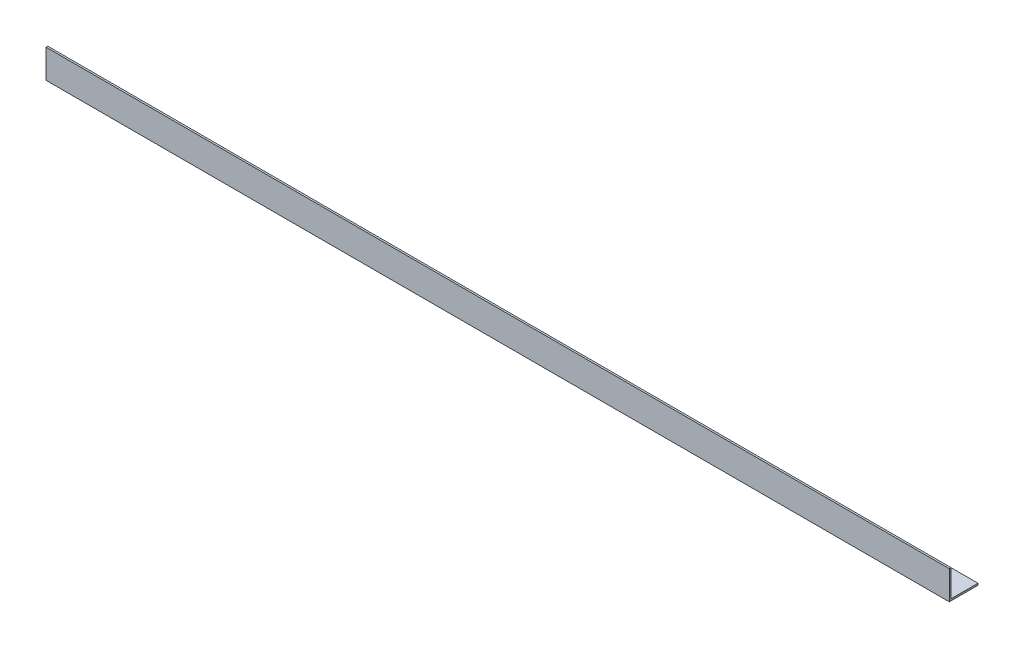
ISO-10303-21;
HEADER;
FILE_DESCRIPTION(('STEP AP214'),'2;1');
FILE_NAME('part.step','',(''),(''),'','','');
FILE_SCHEMA(('AUTOMOTIVE_DESIGN { 1 0 10303 214 1 1 1 1 }'));
ENDSEC;
DATA;
#1=APPLICATION_CONTEXT('core data for automotive mechanical design processes');
#2=APPLICATION_PROTOCOL_DEFINITION('international standard','automotive_design',2000,#1);
#3=PRODUCT_CONTEXT('',#1,'mechanical');
#4=PRODUCT('Part','Part','',(#3));
#5=PRODUCT_RELATED_PRODUCT_CATEGORY('part','',(#4));
#6=PRODUCT_DEFINITION_FORMATION('','',#4);
#7=PRODUCT_DEFINITION_CONTEXT('part definition',#1,'design');
#8=PRODUCT_DEFINITION('design','',#6,#7);
#9=PRODUCT_DEFINITION_SHAPE('','',#8);
#10=(LENGTH_UNIT() NAMED_UNIT(*) SI_UNIT(.MILLI.,.METRE.));
#11=(NAMED_UNIT(*) PLANE_ANGLE_UNIT() SI_UNIT($,.RADIAN.));
#12=(NAMED_UNIT(*) SI_UNIT($,.STERADIAN.) SOLID_ANGLE_UNIT());
#13=UNCERTAINTY_MEASURE_WITH_UNIT(LENGTH_MEASURE(1.E-05),#10,'distance_accuracy_value','');
#14=(GEOMETRIC_REPRESENTATION_CONTEXT(3) GLOBAL_UNCERTAINTY_ASSIGNED_CONTEXT((#13)) GLOBAL_UNIT_ASSIGNED_CONTEXT((#10,
#11,#12)) REPRESENTATION_CONTEXT('',''));
#15=CARTESIAN_POINT('',(0.,0.,0.));
#16=DIRECTION('',(0.,0.,1.));
#17=DIRECTION('',(1.,0.,0.));
#18=AXIS2_PLACEMENT_3D('',#15,#16,#17);
#19=CARTESIAN_POINT('',(800.1,0.,0.));
#20=DIRECTION('',(0.,1.,0.));
#21=DIRECTION('',(0.,0.,1.));
#22=AXIS2_PLACEMENT_3D('',#19,#20,#21);
#23=PLANE('',#22);
#24=DIRECTION('',(0.,0.,-1.));
#25=VECTOR('',#24,1.);
#26=CARTESIAN_POINT('',(0.,0.,0.));
#27=LINE('',#26,#25);
#28=CARTESIAN_POINT('',(0.,0.,0.));
#29=VERTEX_POINT('',#28);
#30=CARTESIAN_POINT('',(0.,0.,-25.4));
#31=VERTEX_POINT('',#30);
#32=EDGE_CURVE('E121',#29,#31,#27,.T.);
#33=ORIENTED_EDGE('',*,*,#32,.T.);
#34=DIRECTION('',(-1.,0.,0.));
#35=VECTOR('',#34,1.);
#36=CARTESIAN_POINT('',(800.1,0.,-25.4));
#37=LINE('',#36,#35);
#38=CARTESIAN_POINT('',(800.1,0.,-25.4));
#39=VERTEX_POINT('',#38);
#40=EDGE_CURVE('E11',#39,#31,#37,.T.);
#41=ORIENTED_EDGE('',*,*,#40,.F.);
#42=DIRECTION('',(0.,0.,-1.));
#43=VECTOR('',#42,1.);
#44=CARTESIAN_POINT('',(800.1,0.,0.));
#45=LINE('',#44,#43);
#46=CARTESIAN_POINT('',(800.1,0.,0.));
#47=VERTEX_POINT('',#46);
#48=EDGE_CURVE('E131',#47,#39,#45,.T.);
#49=ORIENTED_EDGE('',*,*,#48,.F.);
#50=DIRECTION('',(-1.,0.,0.));
#51=VECTOR('',#50,1.);
#52=CARTESIAN_POINT('',(800.1,0.,0.));
#53=LINE('',#52,#51);
#54=EDGE_CURVE('E117',#47,#29,#53,.T.);
#55=ORIENTED_EDGE('',*,*,#54,.T.);
#56=EDGE_LOOP('',(#33,#41,#49,#55));
#57=FACE_BOUND('',#56,.T.);
#58=ADVANCED_FACE('F37',(#57),#23,.F.);
#59=CARTESIAN_POINT('',(800.1,0.,-25.4));
#60=DIRECTION('',(0.,0.,1.));
#61=DIRECTION('',(1.,0.,0.));
#62=AXIS2_PLACEMENT_3D('',#59,#60,#61);
#63=PLANE('',#62);
#64=DIRECTION('',(0.,1.,0.));
#65=VECTOR('',#64,1.);
#66=CARTESIAN_POINT('',(0.,0.,-25.4));
#67=LINE('',#66,#65);
#68=CARTESIAN_POINT('',(0.,1.5875,-25.4));
#69=VERTEX_POINT('',#68);
#70=EDGE_CURVE('E124',#31,#69,#67,.T.);
#71=ORIENTED_EDGE('',*,*,#70,.T.);
#72=DIRECTION('',(-1.,0.,0.));
#73=VECTOR('',#72,1.);
#74=CARTESIAN_POINT('',(800.1,1.5875,-25.4));
#75=LINE('',#74,#73);
#76=CARTESIAN_POINT('',(800.1,1.5875,-25.4));
#77=VERTEX_POINT('',#76);
#78=EDGE_CURVE('E45',#77,#69,#75,.T.);
#79=ORIENTED_EDGE('',*,*,#78,.F.);
#80=DIRECTION('',(0.,1.,0.));
#81=VECTOR('',#80,1.);
#82=CARTESIAN_POINT('',(800.1,0.,-25.4));
#83=LINE('',#82,#81);
#84=EDGE_CURVE('E90',#39,#77,#83,.T.);
#85=ORIENTED_EDGE('',*,*,#84,.F.);
#86=ORIENTED_EDGE('',*,*,#40,.T.);
#87=EDGE_LOOP('',(#71,#79,#85,#86));
#88=FACE_BOUND('',#87,.T.);
#89=ADVANCED_FACE('F155',(#88),#63,.F.);
#90=CARTESIAN_POINT('',(800.1,1.5875,-25.4));
#91=DIRECTION('',(0.,-1.,0.));
#92=DIRECTION('',(0.,0.,-1.));
#93=AXIS2_PLACEMENT_3D('',#90,#91,#92);
#94=PLANE('',#93);
#95=DIRECTION('',(0.,0.,1.));
#96=VECTOR('',#95,1.);
#97=CARTESIAN_POINT('',(0.,1.5875,-25.4));
#98=LINE('',#97,#96);
#99=CARTESIAN_POINT('',(0.,1.5875,-1.5875));
#100=VERTEX_POINT('',#99);
#101=EDGE_CURVE('E126',#69,#100,#98,.T.);
#102=ORIENTED_EDGE('',*,*,#101,.T.);
#103=DIRECTION('',(-1.,0.,0.));
#104=VECTOR('',#103,1.);
#105=CARTESIAN_POINT('',(800.1,1.5875,-1.5875));
#106=LINE('',#105,#104);
#107=CARTESIAN_POINT('',(800.1,1.5875,-1.5875));
#108=VERTEX_POINT('',#107);
#109=EDGE_CURVE('E112',#108,#100,#106,.T.);
#110=ORIENTED_EDGE('',*,*,#109,.F.);
#111=DIRECTION('',(0.,0.,1.));
#112=VECTOR('',#111,1.);
#113=CARTESIAN_POINT('',(800.1,1.5875,-25.4));
#114=LINE('',#113,#112);
#115=EDGE_CURVE('E103',#77,#108,#114,.T.);
#116=ORIENTED_EDGE('',*,*,#115,.F.);
#117=ORIENTED_EDGE('',*,*,#78,.T.);
#118=EDGE_LOOP('',(#102,#110,#116,#117));
#119=FACE_BOUND('',#118,.T.);
#120=ADVANCED_FACE('F137',(#119),#94,.F.);
#121=CARTESIAN_POINT('',(800.1,1.5875,-1.5875));
#122=DIRECTION('',(0.,0.,1.));
#123=DIRECTION('',(0.,-1.,0.));
#124=AXIS2_PLACEMENT_3D('',#121,#122,#123);
#125=PLANE('',#124);
#126=DIRECTION('',(0.,1.,0.));
#127=VECTOR('',#126,1.);
#128=CARTESIAN_POINT('',(0.,1.5875,-1.5875));
#129=LINE('',#128,#127);
#130=CARTESIAN_POINT('',(0.,25.4,-1.5875));
#131=VERTEX_POINT('',#130);
#132=EDGE_CURVE('E111',#100,#131,#129,.T.);
#133=ORIENTED_EDGE('',*,*,#132,.T.);
#134=DIRECTION('',(-1.,0.,0.));
#135=VECTOR('',#134,1.);
#136=CARTESIAN_POINT('',(800.1,25.4,-1.5875));
#137=LINE('',#136,#135);
#138=CARTESIAN_POINT('',(800.1,25.4,-1.5875));
#139=VERTEX_POINT('',#138);
#140=EDGE_CURVE('E108',#139,#131,#137,.T.);
#141=ORIENTED_EDGE('',*,*,#140,.F.);
#142=DIRECTION('',(0.,1.,0.));
#143=VECTOR('',#142,1.);
#144=CARTESIAN_POINT('',(800.1,1.5875,-1.5875));
#145=LINE('',#144,#143);
#146=EDGE_CURVE('E97',#108,#139,#145,.T.);
#147=ORIENTED_EDGE('',*,*,#146,.F.);
#148=ORIENTED_EDGE('',*,*,#109,.T.);
#149=EDGE_LOOP('',(#133,#141,#147,#148));
#150=FACE_BOUND('',#149,.T.);
#151=ADVANCED_FACE('F109',(#150),#125,.F.);
#152=CARTESIAN_POINT('',(800.1,25.4,-1.5875));
#153=DIRECTION('',(0.,-1.,0.));
#154=DIRECTION('',(0.,0.,-1.));
#155=AXIS2_PLACEMENT_3D('',#152,#153,#154);
#156=PLANE('',#155);
#157=DIRECTION('',(0.,0.,1.));
#158=VECTOR('',#157,1.);
#159=CARTESIAN_POINT('',(0.,25.4,-1.5875));
#160=LINE('',#159,#158);
#161=CARTESIAN_POINT('',(0.,25.4,0.));
#162=VERTEX_POINT('',#161);
#163=EDGE_CURVE('E76',#131,#162,#160,.T.);
#164=ORIENTED_EDGE('',*,*,#163,.T.);
#165=DIRECTION('',(-1.,0.,0.));
#166=VECTOR('',#165,1.);
#167=CARTESIAN_POINT('',(800.1,25.4,0.));
#168=LINE('',#167,#166);
#169=CARTESIAN_POINT('',(800.1,25.4,0.));
#170=VERTEX_POINT('',#169);
#171=EDGE_CURVE('E113',#170,#162,#168,.T.);
#172=ORIENTED_EDGE('',*,*,#171,.F.);
#173=DIRECTION('',(0.,0.,1.));
#174=VECTOR('',#173,1.);
#175=CARTESIAN_POINT('',(800.1,25.4,-1.5875));
#176=LINE('',#175,#174);
#177=EDGE_CURVE('E101',#139,#170,#176,.T.);
#178=ORIENTED_EDGE('',*,*,#177,.F.);
#179=ORIENTED_EDGE('',*,*,#140,.T.);
#180=EDGE_LOOP('',(#164,#172,#178,#179));
#181=FACE_BOUND('',#180,.T.);
#182=ADVANCED_FACE('F115',(#181),#156,.F.);
#183=CARTESIAN_POINT('',(800.1,0.,0.));
#184=DIRECTION('',(0.,0.,-1.));
#185=DIRECTION('',(-1.,0.,0.));
#186=AXIS2_PLACEMENT_3D('',#183,#184,#185);
#187=PLANE('',#186);
#188=DIRECTION('',(0.,-1.,0.));
#189=VECTOR('',#188,1.);
#190=CARTESIAN_POINT('',(0.,0.,0.));
#191=LINE('',#190,#189);
#192=EDGE_CURVE('E82',#162,#29,#191,.T.);
#193=ORIENTED_EDGE('',*,*,#192,.T.);
#194=ORIENTED_EDGE('',*,*,#54,.F.);
#195=DIRECTION('',(0.,-1.,0.));
#196=VECTOR('',#195,1.);
#197=CARTESIAN_POINT('',(800.1,0.,0.));
#198=LINE('',#197,#196);
#199=EDGE_CURVE('E53',#170,#47,#198,.T.);
#200=ORIENTED_EDGE('',*,*,#199,.F.);
#201=ORIENTED_EDGE('',*,*,#171,.T.);
#202=EDGE_LOOP('',(#193,#194,#200,#201));
#203=FACE_BOUND('',#202,.T.);
#204=ADVANCED_FACE('F144',(#203),#187,.F.);
#205=CARTESIAN_POINT('',(800.1,0.,0.));
#206=DIRECTION('',(1.,0.,0.));
#207=DIRECTION('',(0.,0.,-1.));
#208=AXIS2_PLACEMENT_3D('',#205,#206,#207);
#209=PLANE('',#208);
#210=ORIENTED_EDGE('',*,*,#48,.T.);
#211=ORIENTED_EDGE('',*,*,#84,.T.);
#212=ORIENTED_EDGE('',*,*,#115,.T.);
#213=ORIENTED_EDGE('',*,*,#146,.T.);
#214=ORIENTED_EDGE('',*,*,#177,.T.);
#215=ORIENTED_EDGE('',*,*,#199,.T.);
#216=EDGE_LOOP('',(#210,#211,#212,#213,#214,#215));
#217=FACE_BOUND('',#216,.T.);
#218=ADVANCED_FACE('F99',(#217),#209,.T.);
#219=CARTESIAN_POINT('',(0.,0.,0.));
#220=DIRECTION('',(1.,0.,0.));
#221=DIRECTION('',(0.,0.,-1.));
#222=AXIS2_PLACEMENT_3D('',#219,#220,#221);
#223=PLANE('',#222);
#224=ORIENTED_EDGE('',*,*,#32,.F.);
#225=ORIENTED_EDGE('',*,*,#192,.F.);
#226=ORIENTED_EDGE('',*,*,#163,.F.);
#227=ORIENTED_EDGE('',*,*,#132,.F.);
#228=ORIENTED_EDGE('',*,*,#101,.F.);
#229=ORIENTED_EDGE('',*,*,#70,.F.);
#230=EDGE_LOOP('',(#224,#225,#226,#227,#228,#229));
#231=FACE_BOUND('',#230,.T.);
#232=ADVANCED_FACE('F140',(#231),#223,.F.);
#233=CLOSED_SHELL('',(#58,#89,#120,#151,#182,#204,#218,#232));
#234=MANIFOLD_SOLID_BREP('B2',#233);
#235=ADVANCED_BREP_SHAPE_REPRESENTATION('',(#18,#234),#14);
#236=SHAPE_DEFINITION_REPRESENTATION(#9,#235);
ENDSEC;
END-ISO-10303-21;
